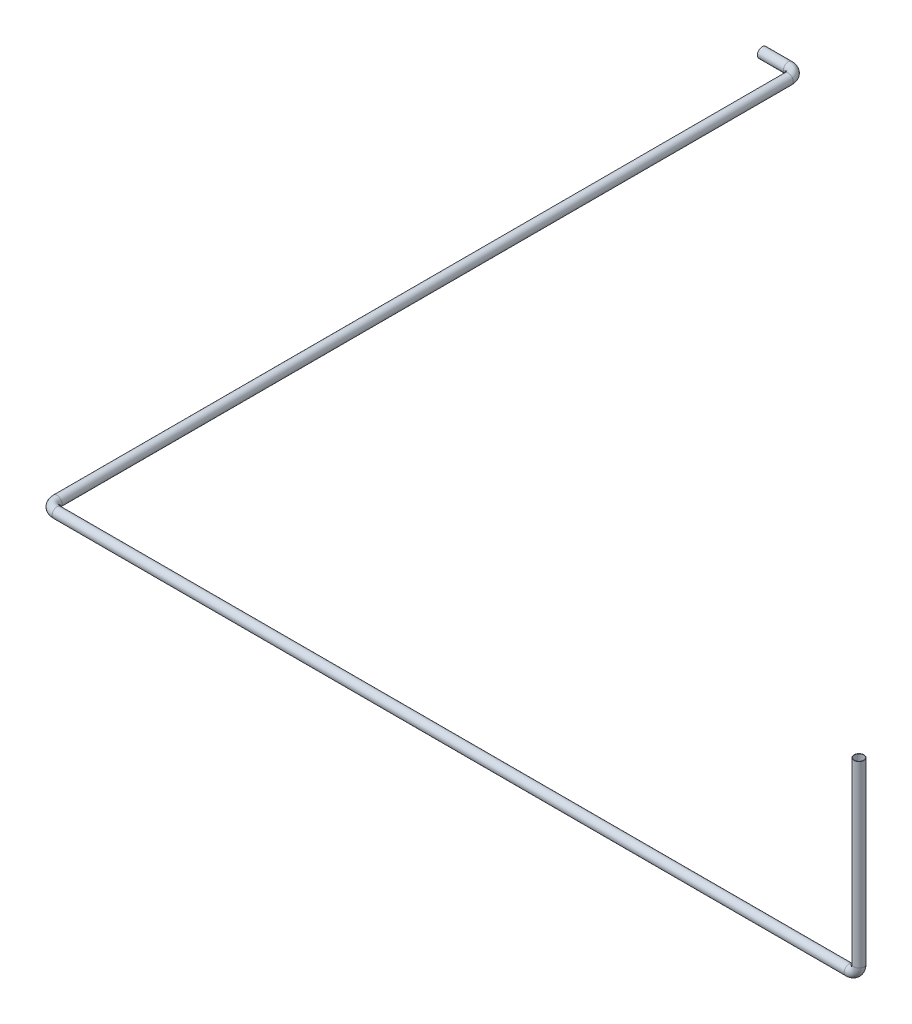
ISO-10303-21;
HEADER;
FILE_DESCRIPTION(('STEP AP214'),'2;1');
FILE_NAME('part.step','',(''),(''),'','','');
FILE_SCHEMA(('AUTOMOTIVE_DESIGN { 1 0 10303 214 1 1 1 1 }'));
ENDSEC;
DATA;
#1=APPLICATION_CONTEXT('core data for automotive mechanical design processes');
#2=APPLICATION_PROTOCOL_DEFINITION('international standard','automotive_design',2000,#1);
#3=PRODUCT_CONTEXT('',#1,'mechanical');
#4=PRODUCT('Part','Part','',(#3));
#5=PRODUCT_RELATED_PRODUCT_CATEGORY('part','',(#4));
#6=PRODUCT_DEFINITION_FORMATION('','',#4);
#7=PRODUCT_DEFINITION_CONTEXT('part definition',#1,'design');
#8=PRODUCT_DEFINITION('design','',#6,#7);
#9=PRODUCT_DEFINITION_SHAPE('','',#8);
#10=(LENGTH_UNIT() NAMED_UNIT(*) SI_UNIT(.MILLI.,.METRE.));
#11=(NAMED_UNIT(*) PLANE_ANGLE_UNIT() SI_UNIT($,.RADIAN.));
#12=(NAMED_UNIT(*) SI_UNIT($,.STERADIAN.) SOLID_ANGLE_UNIT());
#13=UNCERTAINTY_MEASURE_WITH_UNIT(LENGTH_MEASURE(1.E-05),#10,'distance_accuracy_value','');
#14=(GEOMETRIC_REPRESENTATION_CONTEXT(3) GLOBAL_UNCERTAINTY_ASSIGNED_CONTEXT((#13)) GLOBAL_UNIT_ASSIGNED_CONTEXT((#10,
#11,#12)) REPRESENTATION_CONTEXT('',''));
#15=CARTESIAN_POINT('',(0.,0.,0.));
#16=DIRECTION('',(0.,0.,1.));
#17=DIRECTION('',(1.,0.,0.));
#18=AXIS2_PLACEMENT_3D('',#15,#16,#17);
#19=CARTESIAN_POINT('',(-31937.4492832491,-16257.8595062918,41333.8243293056));
#20=DIRECTION('',(0.,1.,0.));
#21=DIRECTION('',(0.,0.,-1.));
#22=AXIS2_PLACEMENT_3D('',#19,#20,#21);
#23=PLANE('',#22);
#24=CARTESIAN_POINT('',(-31937.4492832491,-16257.8595062918,41333.8243293056));
#25=DIRECTION('',(0.,1.,0.));
#26=DIRECTION('',(0.,0.,1.));
#27=AXIS2_PLACEMENT_3D('',#24,#25,#26);
#28=CIRCLE('',#27,14.0000000000006);
#29=CARTESIAN_POINT('',(-31937.4492832491,-16257.8595062918,41347.8243293056));
#30=VERTEX_POINT('',#29);
#31=EDGE_CURVE('E82',#30,#30,#28,.T.);
#32=ORIENTED_EDGE('',*,*,#31,.F.);
#33=EDGE_LOOP('',(#32));
#34=FACE_BOUND('',#33,.T.);
#35=CARTESIAN_POINT('',(-31937.4492832491,-16257.8595062918,41333.8243293056));
#36=DIRECTION('',(0.,1.,0.));
#37=DIRECTION('',(0.,0.,-1.));
#38=AXIS2_PLACEMENT_3D('',#35,#36,#37);
#39=CIRCLE('',#38,15.0000000000006);
#40=CARTESIAN_POINT('',(-31937.4492832491,-16257.8595062918,41318.8243293056));
#41=VERTEX_POINT('',#40);
#42=EDGE_CURVE('E75',#41,#41,#39,.T.);
#43=ORIENTED_EDGE('',*,*,#42,.T.);
#44=EDGE_LOOP('',(#43));
#45=FACE_BOUND('',#44,.T.);
#46=ADVANCED_FACE('F47',(#34,#45),#23,.T.);
#47=CARTESIAN_POINT('',(-34513.5186954802,-16831.0208281175,39051.7001960568));
#48=DIRECTION('',(1.,0.,0.));
#49=DIRECTION('',(0.,0.,-1.));
#50=AXIS2_PLACEMENT_3D('',#47,#48,#49);
#51=PLANE('',#50);
#52=CARTESIAN_POINT('',(-34513.5186954802,-16831.0208281175,39051.7001960568));
#53=DIRECTION('',(1.,0.,0.));
#54=DIRECTION('',(0.,0.,-1.));
#55=AXIS2_PLACEMENT_3D('',#52,#53,#54);
#56=CIRCLE('',#55,14.0000000000006);
#57=CARTESIAN_POINT('',(-34513.5186954802,-16831.0208281175,39037.7001960568));
#58=VERTEX_POINT('',#57);
#59=EDGE_CURVE('E78',#58,#58,#56,.T.);
#60=ORIENTED_EDGE('',*,*,#59,.T.);
#61=EDGE_LOOP('',(#60));
#62=FACE_BOUND('',#61,.T.);
#63=CARTESIAN_POINT('',(-34513.5186954802,-16831.0208281175,39051.7001960568));
#64=DIRECTION('',(1.,0.,0.));
#65=DIRECTION('',(0.,0.,-1.));
#66=AXIS2_PLACEMENT_3D('',#63,#64,#65);
#67=CIRCLE('',#66,15.0000000000006);
#68=CARTESIAN_POINT('',(-34513.5186954802,-16831.0208281175,39036.7001960568));
#69=VERTEX_POINT('',#68);
#70=EDGE_CURVE('E11',#69,#69,#67,.T.);
#71=ORIENTED_EDGE('',*,*,#70,.F.);
#72=EDGE_LOOP('',(#71));
#73=FACE_BOUND('',#72,.T.);
#74=ADVANCED_FACE('F114',(#62,#73),#51,.F.);
#75=CARTESIAN_POINT('',(-31937.4492832491,-16257.8595062918,41333.8243293056));
#76=DIRECTION('',(0.,-1.,0.));
#77=DIRECTION('',(0.,0.,-1.));
#78=AXIS2_PLACEMENT_3D('',#75,#76,#77);
#79=CYLINDRICAL_SURFACE('',#78,15.0000000000006);
#80=CARTESIAN_POINT('',(-31937.4492832491,-16801.0208281175,41333.8243293056));
#81=DIRECTION('',(0.,1.,0.));
#82=DIRECTION('',(0.,0.,-1.));
#83=AXIS2_PLACEMENT_3D('',#80,#81,#82);
#84=CIRCLE('',#83,15.0000000000006);
#85=CARTESIAN_POINT('',(-31922.4492832491,-16801.0208281175,41333.8243293056));
#86=VERTEX_POINT('',#85);
#87=EDGE_CURVE('E72',#86,#86,#84,.T.);
#88=ORIENTED_EDGE('',*,*,#87,.T.);
#89=EDGE_LOOP('',(#88));
#90=FACE_BOUND('',#89,.T.);
#91=ORIENTED_EDGE('',*,*,#42,.F.);
#92=EDGE_LOOP('',(#91));
#93=FACE_BOUND('',#92,.T.);
#94=ADVANCED_FACE('F118',(#90,#93),#79,.T.);
#95=CARTESIAN_POINT('',(-31967.4492832491,-16801.0208281175,41333.8243293056));
#96=DIRECTION('',(0.,0.,-1.));
#97=DIRECTION('',(-1.,0.,0.));
#98=AXIS2_PLACEMENT_3D('',#95,#96,#97);
#99=TOROIDAL_SURFACE('',#98,30.0000000000011,15.0000000000006);
#100=CARTESIAN_POINT('',(-31967.4492832511,-16831.0208281134,41333.8243293056));
#101=DIRECTION('',(1.,0.,0.));
#102=DIRECTION('',(0.,0.,-1.));
#103=AXIS2_PLACEMENT_3D('',#100,#101,#102);
#104=CIRCLE('',#103,15.0000000000006);
#105=CARTESIAN_POINT('',(-31967.4492832521,-16846.0208281175,41333.8243293056));
#106=VERTEX_POINT('',#105);
#107=EDGE_CURVE('E69',#106,#106,#104,.T.);
#108=CARTESIAN_POINT('',(-31967.4492832491,-16801.0208281175,41333.8243293056));
#109=DIRECTION('',(0.,0.,-1.));
#110=DIRECTION('',(-1.,0.,0.));
#111=AXIS2_PLACEMENT_3D('',#108,#109,#110);
#112=CIRCLE('',#111,45.0000000000017);
#113=EDGE_CURVE('',#86,#106,#112,.T.);
#114=ORIENTED_EDGE('',*,*,#87,.F.);
#115=ORIENTED_EDGE('',*,*,#107,.T.);
#116=ORIENTED_EDGE('',*,*,#113,.T.);
#117=ORIENTED_EDGE('',*,*,#113,.F.);
#118=EDGE_LOOP('',(#114,#116,#115,#117));
#119=FACE_BOUND('',#118,.T.);
#120=ADVANCED_FACE('F120',(#119),#99,.T.);
#121=CARTESIAN_POINT('',(-31967.4492832491,-16831.0208281175,41333.8243293056));
#122=DIRECTION('',(-1.,0.,0.));
#123=DIRECTION('',(0.,0.,1.));
#124=AXIS2_PLACEMENT_3D('',#121,#122,#123);
#125=CYLINDRICAL_SURFACE('',#124,15.0000000000006);
#126=CARTESIAN_POINT('',(-34374.4733152765,-16831.0208281175,41333.8243293056));
#127=DIRECTION('',(1.,0.,0.));
#128=DIRECTION('',(0.,0.,-1.));
#129=AXIS2_PLACEMENT_3D('',#126,#127,#128);
#130=CIRCLE('',#129,15.0000000000006);
#131=CARTESIAN_POINT('',(-34374.4733152765,-16831.0208281175,41348.8243293138));
#132=VERTEX_POINT('',#131);
#133=EDGE_CURVE('E66',#132,#132,#130,.T.);
#134=ORIENTED_EDGE('',*,*,#133,.T.);
#135=EDGE_LOOP('',(#134));
#136=FACE_BOUND('',#135,.T.);
#137=ORIENTED_EDGE('',*,*,#107,.F.);
#138=EDGE_LOOP('',(#137));
#139=FACE_BOUND('',#138,.T.);
#140=ADVANCED_FACE('F127',(#136,#139),#125,.T.);
#141=CARTESIAN_POINT('',(-34374.4733152765,-16831.0208281175,41303.8243293056));
#142=DIRECTION('',(0.,-1.,0.));
#143=DIRECTION('',(0.,0.,-1.));
#144=AXIS2_PLACEMENT_3D('',#141,#142,#143);
#145=TOROIDAL_SURFACE('',#144,30.0000000081724,15.0000000000006);
#146=CARTESIAN_POINT('',(-34404.4733152765,-16831.0208281175,41303.8243293056));
#147=DIRECTION('',(2.36847578586691E-13,0.,1.));
#148=DIRECTION('',(1.,0.,-2.36847578586691E-13));
#149=AXIS2_PLACEMENT_3D('',#146,#147,#148);
#150=CIRCLE('',#149,15.0000000000006);
#151=CARTESIAN_POINT('',(-34419.4733152846,-16831.0208281175,41303.8243293056));
#152=VERTEX_POINT('',#151);
#153=EDGE_CURVE('E61',#152,#152,#150,.T.);
#154=CARTESIAN_POINT('',(-34374.4733152765,-16831.0208281175,41303.8243293056));
#155=DIRECTION('',(0.,-1.,0.));
#156=DIRECTION('',(0.,0.,-1.));
#157=AXIS2_PLACEMENT_3D('',#154,#155,#156);
#158=CIRCLE('',#157,45.0000000081729);
#159=EDGE_CURVE('',#132,#152,#158,.T.);
#160=ORIENTED_EDGE('',*,*,#133,.F.);
#161=ORIENTED_EDGE('',*,*,#153,.T.);
#162=ORIENTED_EDGE('',*,*,#159,.T.);
#163=ORIENTED_EDGE('',*,*,#159,.F.);
#164=EDGE_LOOP('',(#160,#162,#161,#163));
#165=FACE_BOUND('',#164,.T.);
#166=ADVANCED_FACE('F144',(#165),#145,.T.);
#167=CARTESIAN_POINT('',(-34404.4733152765,-16831.0208281175,41303.8243293056));
#168=DIRECTION('',(0.,0.,-1.));
#169=DIRECTION('',(-1.,0.,0.));
#170=AXIS2_PLACEMENT_3D('',#167,#168,#169);
#171=CYLINDRICAL_SURFACE('',#170,15.0000000000006);
#172=CARTESIAN_POINT('',(-34404.4733152765,-16831.0208281175,39081.7001960568));
#173=DIRECTION('',(0.,0.,1.));
#174=DIRECTION('',(1.,0.,0.));
#175=AXIS2_PLACEMENT_3D('',#172,#173,#174);
#176=CIRCLE('',#175,15.0000000000006);
#177=CARTESIAN_POINT('',(-34389.4733152765,-16831.0208281175,39081.7001960568));
#178=VERTEX_POINT('',#177);
#179=EDGE_CURVE('E57',#178,#178,#176,.T.);
#180=ORIENTED_EDGE('',*,*,#179,.T.);
#181=EDGE_LOOP('',(#180));
#182=FACE_BOUND('',#181,.T.);
#183=ORIENTED_EDGE('',*,*,#153,.F.);
#184=EDGE_LOOP('',(#183));
#185=FACE_BOUND('',#184,.T.);
#186=ADVANCED_FACE('F138',(#182,#185),#171,.T.);
#187=CARTESIAN_POINT('',(-34434.4733152765,-16831.0208281175,39081.7001960568));
#188=DIRECTION('',(0.,1.,0.));
#189=DIRECTION('',(0.,0.,1.));
#190=AXIS2_PLACEMENT_3D('',#187,#188,#189);
#191=TOROIDAL_SURFACE('',#190,30.0000000000011,15.0000000000006);
#192=CARTESIAN_POINT('',(-34434.4733152672,-16831.0208281175,39051.700196065));
#193=DIRECTION('',(1.,0.,0.));
#194=DIRECTION('',(0.,0.,-1.));
#195=AXIS2_PLACEMENT_3D('',#192,#193,#194);
#196=CIRCLE('',#195,15.0000000000006);
#197=CARTESIAN_POINT('',(-34434.4733152626,-16831.0208281175,39036.7001960568));
#198=VERTEX_POINT('',#197);
#199=EDGE_CURVE('E53',#198,#198,#196,.T.);
#200=CARTESIAN_POINT('',(-34434.4733152765,-16831.0208281175,39081.7001960568));
#201=DIRECTION('',(0.,1.,0.));
#202=DIRECTION('',(0.,0.,1.));
#203=AXIS2_PLACEMENT_3D('',#200,#201,#202);
#204=CIRCLE('',#203,45.0000000000017);
#205=EDGE_CURVE('',#178,#198,#204,.T.);
#206=ORIENTED_EDGE('',*,*,#179,.F.);
#207=ORIENTED_EDGE('',*,*,#199,.T.);
#208=ORIENTED_EDGE('',*,*,#205,.T.);
#209=ORIENTED_EDGE('',*,*,#205,.F.);
#210=EDGE_LOOP('',(#206,#208,#207,#209));
#211=FACE_BOUND('',#210,.T.);
#212=ADVANCED_FACE('F133',(#211),#191,.T.);
#213=CARTESIAN_POINT('',(-34434.4733152764,-16831.0208281175,39051.7001960568));
#214=DIRECTION('',(-1.,0.,0.));
#215=DIRECTION('',(0.,0.,1.));
#216=AXIS2_PLACEMENT_3D('',#213,#214,#215);
#217=CYLINDRICAL_SURFACE('',#216,15.0000000000006);
#218=ORIENTED_EDGE('',*,*,#70,.T.);
#219=EDGE_LOOP('',(#218));
#220=FACE_BOUND('',#219,.T.);
#221=ORIENTED_EDGE('',*,*,#199,.F.);
#222=EDGE_LOOP('',(#221));
#223=FACE_BOUND('',#222,.T.);
#224=ADVANCED_FACE('F108',(#220,#223),#217,.T.);
#225=CARTESIAN_POINT('',(-31937.4492832491,-16257.8595062918,41333.8243293056));
#226=DIRECTION('',(0.,-1.,0.));
#227=DIRECTION('',(0.,0.,-1.));
#228=AXIS2_PLACEMENT_3D('',#225,#226,#227);
#229=CYLINDRICAL_SURFACE('',#228,14.0000000000006);
#230=CARTESIAN_POINT('',(-31937.4492832491,-16801.0208281175,41333.8243293056));
#231=DIRECTION('',(0.,-1.,0.));
#232=DIRECTION('',(0.,0.,-1.));
#233=AXIS2_PLACEMENT_3D('',#230,#231,#232);
#234=CIRCLE('',#233,14.0000000000006);
#235=CARTESIAN_POINT('',(-31923.4492832491,-16801.0208281175,41333.8243293056));
#236=VERTEX_POINT('',#235);
#237=EDGE_CURVE('E85',#236,#236,#234,.F.);
#238=ORIENTED_EDGE('',*,*,#237,.F.);
#239=EDGE_LOOP('',(#238));
#240=FACE_BOUND('',#239,.T.);
#241=ORIENTED_EDGE('',*,*,#31,.T.);
#242=EDGE_LOOP('',(#241));
#243=FACE_BOUND('',#242,.T.);
#244=ADVANCED_FACE('F105',(#240,#243),#229,.F.);
#245=CARTESIAN_POINT('',(-31967.4492832491,-16801.0208281175,41333.8243293056));
#246=DIRECTION('',(0.,0.,-1.));
#247=DIRECTION('',(-1.,0.,0.));
#248=AXIS2_PLACEMENT_3D('',#245,#246,#247);
#249=TOROIDAL_SURFACE('',#248,30.0000000000011,14.0000000000006);
#250=CARTESIAN_POINT('',(-31967.4492832511,-16831.0208281175,41333.8243293056));
#251=DIRECTION('',(-1.,0.,0.));
#252=DIRECTION('',(0.,0.,1.));
#253=AXIS2_PLACEMENT_3D('',#250,#251,#252);
#254=CIRCLE('',#253,14.0000000000006);
#255=CARTESIAN_POINT('',(-31967.449283252,-16845.0208281175,41333.8243293056));
#256=VERTEX_POINT('',#255);
#257=EDGE_CURVE('E97',#256,#256,#254,.F.);
#258=CARTESIAN_POINT('',(-31967.4492832491,-16801.0208281175,41333.8243293056));
#259=DIRECTION('',(0.,0.,-1.));
#260=DIRECTION('',(-1.,0.,0.));
#261=AXIS2_PLACEMENT_3D('',#258,#259,#260);
#262=CIRCLE('',#261,44.0000000000017);
#263=EDGE_CURVE('',#236,#256,#262,.T.);
#264=ORIENTED_EDGE('',*,*,#237,.T.);
#265=ORIENTED_EDGE('',*,*,#257,.F.);
#266=ORIENTED_EDGE('',*,*,#263,.T.);
#267=ORIENTED_EDGE('',*,*,#263,.F.);
#268=EDGE_LOOP('',(#264,#266,#265,#267));
#269=FACE_BOUND('',#268,.T.);
#270=ADVANCED_FACE('F103',(#269),#249,.F.);
#271=CARTESIAN_POINT('',(-31967.4492832491,-16831.0208281175,41333.8243293056));
#272=DIRECTION('',(-1.,0.,0.));
#273=DIRECTION('',(0.,0.,1.));
#274=AXIS2_PLACEMENT_3D('',#271,#272,#273);
#275=CYLINDRICAL_SURFACE('',#274,14.0000000000006);
#276=CARTESIAN_POINT('',(-34374.4733152765,-16831.0208281175,41333.8243293056));
#277=DIRECTION('',(-1.,0.,0.));
#278=DIRECTION('',(0.,0.,1.));
#279=AXIS2_PLACEMENT_3D('',#276,#277,#278);
#280=CIRCLE('',#279,14.0000000000006);
#281=CARTESIAN_POINT('',(-34374.4733152765,-16831.0208281175,41347.8243293138));
#282=VERTEX_POINT('',#281);
#283=EDGE_CURVE('E94',#282,#282,#280,.F.);
#284=ORIENTED_EDGE('',*,*,#283,.F.);
#285=EDGE_LOOP('',(#284));
#286=FACE_BOUND('',#285,.T.);
#287=ORIENTED_EDGE('',*,*,#257,.T.);
#288=EDGE_LOOP('',(#287));
#289=FACE_BOUND('',#288,.T.);
#290=ADVANCED_FACE('F195',(#286,#289),#275,.F.);
#291=CARTESIAN_POINT('',(-34374.4733152765,-16831.0208281175,41303.8243293056));
#292=DIRECTION('',(0.,-1.,0.));
#293=DIRECTION('',(0.,0.,-1.));
#294=AXIS2_PLACEMENT_3D('',#291,#292,#293);
#295=TOROIDAL_SURFACE('',#294,30.0000000081724,14.0000000000006);
#296=CARTESIAN_POINT('',(-34404.4733152846,-16831.0208281175,41303.8243293056));
#297=DIRECTION('',(1.58279455726494E-13,0.,1.));
#298=DIRECTION('',(1.,0.,-1.58279455726494E-13));
#299=AXIS2_PLACEMENT_3D('',#296,#297,#298);
#300=CIRCLE('',#299,14.0000000000006);
#301=CARTESIAN_POINT('',(-34418.4733152846,-16831.0208281175,41303.8243293056));
#302=VERTEX_POINT('',#301);
#303=EDGE_CURVE('E91',#302,#302,#300,.T.);
#304=CARTESIAN_POINT('',(-34374.4733152765,-16831.0208281175,41303.8243293056));
#305=DIRECTION('',(0.,-1.,0.));
#306=DIRECTION('',(0.,0.,-1.));
#307=AXIS2_PLACEMENT_3D('',#304,#305,#306);
#308=CIRCLE('',#307,44.0000000081729);
#309=EDGE_CURVE('',#282,#302,#308,.T.);
#310=ORIENTED_EDGE('',*,*,#283,.T.);
#311=ORIENTED_EDGE('',*,*,#303,.F.);
#312=ORIENTED_EDGE('',*,*,#309,.T.);
#313=ORIENTED_EDGE('',*,*,#309,.F.);
#314=EDGE_LOOP('',(#310,#312,#311,#313));
#315=FACE_BOUND('',#314,.T.);
#316=ADVANCED_FACE('F206',(#315),#295,.F.);
#317=CARTESIAN_POINT('',(-34404.4733152765,-16831.0208281175,41303.8243293056));
#318=DIRECTION('',(0.,0.,-1.));
#319=DIRECTION('',(-1.,0.,0.));
#320=AXIS2_PLACEMENT_3D('',#317,#318,#319);
#321=CYLINDRICAL_SURFACE('',#320,14.0000000000006);
#322=CARTESIAN_POINT('',(-34404.4733152765,-16831.0208281175,39081.7001960568));
#323=DIRECTION('',(0.,0.,-1.));
#324=DIRECTION('',(-1.,0.,0.));
#325=AXIS2_PLACEMENT_3D('',#322,#323,#324);
#326=CIRCLE('',#325,14.0000000000006);
#327=CARTESIAN_POINT('',(-34390.4733152765,-16831.0208281175,39081.7001960568));
#328=VERTEX_POINT('',#327);
#329=EDGE_CURVE('E88',#328,#328,#326,.F.);
#330=ORIENTED_EDGE('',*,*,#329,.F.);
#331=EDGE_LOOP('',(#330));
#332=FACE_BOUND('',#331,.T.);
#333=ORIENTED_EDGE('',*,*,#303,.T.);
#334=EDGE_LOOP('',(#333));
#335=FACE_BOUND('',#334,.T.);
#336=ADVANCED_FACE('F217',(#332,#335),#321,.F.);
#337=CARTESIAN_POINT('',(-34434.4733152765,-16831.0208281175,39081.7001960568));
#338=DIRECTION('',(0.,1.,0.));
#339=DIRECTION('',(0.,0.,1.));
#340=AXIS2_PLACEMENT_3D('',#337,#338,#339);
#341=TOROIDAL_SURFACE('',#340,30.0000000000011,14.0000000000006);
#342=CARTESIAN_POINT('',(-34434.4733152672,-16831.0208281175,39051.7001960568));
#343=DIRECTION('',(-1.,0.,0.));
#344=DIRECTION('',(0.,0.,1.));
#345=AXIS2_PLACEMENT_3D('',#342,#343,#344);
#346=CIRCLE('',#345,14.0000000000006);
#347=CARTESIAN_POINT('',(-34434.4733152629,-16831.0208281175,39037.7001960568));
#348=VERTEX_POINT('',#347);
#349=EDGE_CURVE('E81',#348,#348,#346,.F.);
#350=CARTESIAN_POINT('',(-34434.4733152765,-16831.0208281175,39081.7001960568));
#351=DIRECTION('',(0.,1.,0.));
#352=DIRECTION('',(0.,0.,1.));
#353=AXIS2_PLACEMENT_3D('',#350,#351,#352);
#354=CIRCLE('',#353,44.0000000000017);
#355=EDGE_CURVE('',#328,#348,#354,.T.);
#356=ORIENTED_EDGE('',*,*,#329,.T.);
#357=ORIENTED_EDGE('',*,*,#349,.F.);
#358=ORIENTED_EDGE('',*,*,#355,.T.);
#359=ORIENTED_EDGE('',*,*,#355,.F.);
#360=EDGE_LOOP('',(#356,#358,#357,#359));
#361=FACE_BOUND('',#360,.T.);
#362=ADVANCED_FACE('F228',(#361),#341,.F.);
#363=CARTESIAN_POINT('',(-34434.4733152764,-16831.0208281175,39051.7001960568));
#364=DIRECTION('',(-1.,0.,0.));
#365=DIRECTION('',(0.,0.,1.));
#366=AXIS2_PLACEMENT_3D('',#363,#364,#365);
#367=CYLINDRICAL_SURFACE('',#366,14.0000000000006);
#368=ORIENTED_EDGE('',*,*,#59,.F.);
#369=EDGE_LOOP('',(#368));
#370=FACE_BOUND('',#369,.T.);
#371=ORIENTED_EDGE('',*,*,#349,.T.);
#372=EDGE_LOOP('',(#371));
#373=FACE_BOUND('',#372,.T.);
#374=ADVANCED_FACE('F115',(#370,#373),#367,.F.);
#375=CLOSED_SHELL('',(#46,#74,#94,#120,#140,#166,#186,#212,#224,#244,#270,#290,#316,#336,#362,#374));
#376=MANIFOLD_SOLID_BREP('B2',#375);
#377=ADVANCED_BREP_SHAPE_REPRESENTATION('',(#18,#376),#14);
#378=SHAPE_DEFINITION_REPRESENTATION(#9,#377);
ENDSEC;
END-ISO-10303-21;
